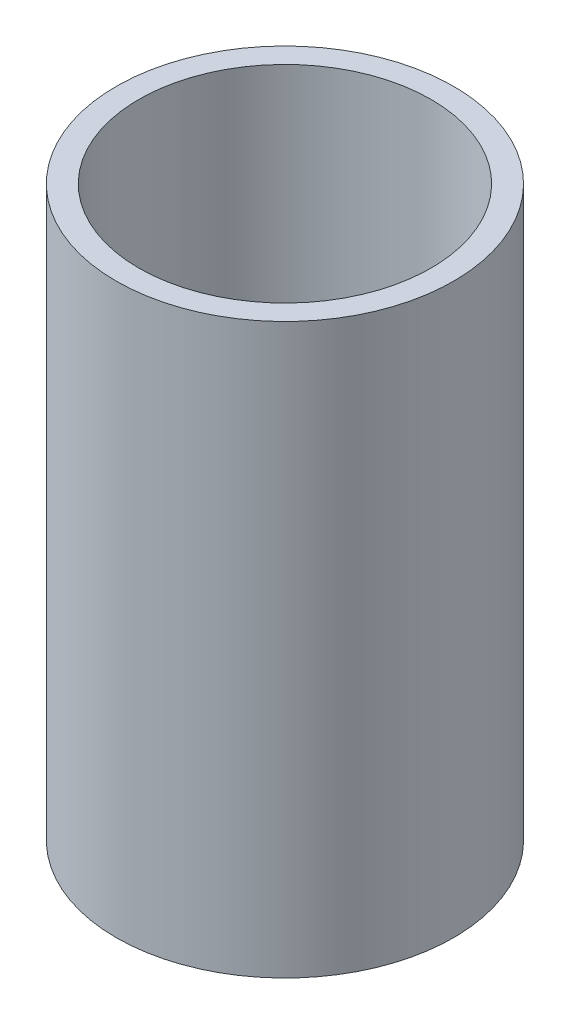
ISO-10303-21;
HEADER;
FILE_DESCRIPTION(('STEP AP214'),'2;1');
FILE_NAME('part.step','',(''),(''),'','','');
FILE_SCHEMA(('AUTOMOTIVE_DESIGN { 1 0 10303 214 1 1 1 1 }'));
ENDSEC;
DATA;
#1=APPLICATION_CONTEXT('core data for automotive mechanical design processes');
#2=APPLICATION_PROTOCOL_DEFINITION('international standard','automotive_design',2000,#1);
#3=PRODUCT_CONTEXT('',#1,'mechanical');
#4=PRODUCT('Part','Part','',(#3));
#5=PRODUCT_RELATED_PRODUCT_CATEGORY('part','',(#4));
#6=PRODUCT_DEFINITION_FORMATION('','',#4);
#7=PRODUCT_DEFINITION_CONTEXT('part definition',#1,'design');
#8=PRODUCT_DEFINITION('design','',#6,#7);
#9=PRODUCT_DEFINITION_SHAPE('','',#8);
#10=(LENGTH_UNIT() NAMED_UNIT(*) SI_UNIT(.MILLI.,.METRE.));
#11=(NAMED_UNIT(*) PLANE_ANGLE_UNIT() SI_UNIT($,.RADIAN.));
#12=(NAMED_UNIT(*) SI_UNIT($,.STERADIAN.) SOLID_ANGLE_UNIT());
#13=UNCERTAINTY_MEASURE_WITH_UNIT(LENGTH_MEASURE(1.E-05),#10,'distance_accuracy_value','');
#14=(GEOMETRIC_REPRESENTATION_CONTEXT(3) GLOBAL_UNCERTAINTY_ASSIGNED_CONTEXT((#13)) GLOBAL_UNIT_ASSIGNED_CONTEXT((#10,
#11,#12)) REPRESENTATION_CONTEXT('',''));
#15=CARTESIAN_POINT('',(0.,0.,0.));
#16=DIRECTION('',(0.,0.,1.));
#17=DIRECTION('',(1.,0.,0.));
#18=AXIS2_PLACEMENT_3D('',#15,#16,#17);
#19=CARTESIAN_POINT('',(0.,126.378420375831,0.));
#20=DIRECTION('',(0.,-1.,0.));
#21=DIRECTION('',(0.,0.,-1.));
#22=AXIS2_PLACEMENT_3D('',#19,#20,#21);
#23=CYLINDRICAL_SURFACE('',#22,37.5);
#24=CARTESIAN_POINT('',(0.,126.378420375831,0.));
#25=DIRECTION('',(0.,1.,0.));
#26=DIRECTION('',(0.,0.,1.));
#27=AXIS2_PLACEMENT_3D('',#24,#25,#26);
#28=CIRCLE('',#27,37.5);
#29=CARTESIAN_POINT('',(0.,126.378420375831,37.5));
#30=VERTEX_POINT('',#29);
#31=EDGE_CURVE('E10',#30,#30,#28,.T.);
#32=ORIENTED_EDGE('',*,*,#31,.F.);
#33=EDGE_LOOP('',(#32));
#34=FACE_BOUND('',#33,.T.);
#35=CARTESIAN_POINT('',(0.,0.,0.));
#36=DIRECTION('',(0.,1.,0.));
#37=DIRECTION('',(0.,0.,1.));
#38=AXIS2_PLACEMENT_3D('',#35,#36,#37);
#39=CIRCLE('',#38,37.5);
#40=CARTESIAN_POINT('',(0.,0.,37.5));
#41=VERTEX_POINT('',#40);
#42=EDGE_CURVE('E37',#41,#41,#39,.T.);
#43=ORIENTED_EDGE('',*,*,#42,.T.);
#44=EDGE_LOOP('',(#43));
#45=FACE_BOUND('',#44,.T.);
#46=ADVANCED_FACE('F40',(#34,#45),#23,.T.);
#47=CARTESIAN_POINT('',(0.,126.378420375831,0.));
#48=DIRECTION('',(0.,1.,0.));
#49=DIRECTION('',(0.,0.,1.));
#50=AXIS2_PLACEMENT_3D('',#47,#48,#49);
#51=PLANE('',#50);
#52=CARTESIAN_POINT('',(0.,126.378420375831,0.));
#53=DIRECTION('',(0.,1.,0.));
#54=DIRECTION('',(0.,0.,1.));
#55=AXIS2_PLACEMENT_3D('',#52,#53,#54);
#56=CIRCLE('',#55,32.482020694434);
#57=CARTESIAN_POINT('',(0.,126.378420375831,32.482020694434));
#58=VERTEX_POINT('',#57);
#59=EDGE_CURVE('E50',#58,#58,#56,.T.);
#60=ORIENTED_EDGE('',*,*,#59,.F.);
#61=EDGE_LOOP('',(#60));
#62=FACE_BOUND('',#61,.T.);
#63=ORIENTED_EDGE('',*,*,#31,.T.);
#64=EDGE_LOOP('',(#63));
#65=FACE_BOUND('',#64,.T.);
#66=ADVANCED_FACE('F59',(#62,#65),#51,.T.);
#67=CARTESIAN_POINT('',(0.,0.,0.));
#68=DIRECTION('',(0.,1.,0.));
#69=DIRECTION('',(0.,0.,1.));
#70=AXIS2_PLACEMENT_3D('',#67,#68,#69);
#71=PLANE('',#70);
#72=CARTESIAN_POINT('',(0.,0.,0.));
#73=DIRECTION('',(0.,1.,0.));
#74=DIRECTION('',(0.,0.,1.));
#75=AXIS2_PLACEMENT_3D('',#72,#73,#74);
#76=CIRCLE('',#75,32.482020694434);
#77=CARTESIAN_POINT('',(0.,0.,32.482020694434));
#78=VERTEX_POINT('',#77);
#79=EDGE_CURVE('E47',#78,#78,#76,.T.);
#80=ORIENTED_EDGE('',*,*,#79,.T.);
#81=EDGE_LOOP('',(#80));
#82=FACE_BOUND('',#81,.T.);
#83=ORIENTED_EDGE('',*,*,#42,.F.);
#84=EDGE_LOOP('',(#83));
#85=FACE_BOUND('',#84,.T.);
#86=ADVANCED_FACE('F58',(#82,#85),#71,.F.);
#87=CARTESIAN_POINT('',(0.,126.378420375831,0.));
#88=DIRECTION('',(0.,-1.,0.));
#89=DIRECTION('',(0.,0.,-1.));
#90=AXIS2_PLACEMENT_3D('',#87,#88,#89);
#91=CYLINDRICAL_SURFACE('',#90,32.482020694434);
#92=ORIENTED_EDGE('',*,*,#59,.T.);
#93=EDGE_LOOP('',(#92));
#94=FACE_BOUND('',#93,.T.);
#95=ORIENTED_EDGE('',*,*,#79,.F.);
#96=EDGE_LOOP('',(#95));
#97=FACE_BOUND('',#96,.T.);
#98=ADVANCED_FACE('F54',(#94,#97),#91,.F.);
#99=CLOSED_SHELL('',(#46,#66,#86,#98));
#100=MANIFOLD_SOLID_BREP('B2',#99);
#101=ADVANCED_BREP_SHAPE_REPRESENTATION('',(#18,#100),#14);
#102=SHAPE_DEFINITION_REPRESENTATION(#9,#101);
ENDSEC;
END-ISO-10303-21;
